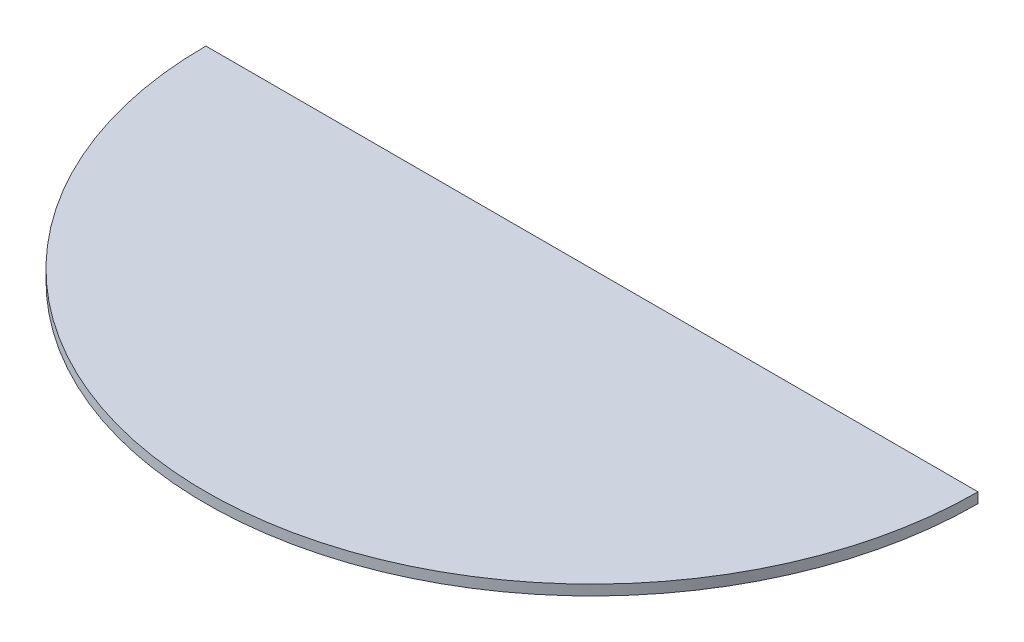
ISO-10303-21;
HEADER;
FILE_DESCRIPTION(('STEP AP214'),'2;1');
FILE_NAME('part.step','',(''),(''),'','','');
FILE_SCHEMA(('AUTOMOTIVE_DESIGN { 1 0 10303 214 1 1 1 1 }'));
ENDSEC;
DATA;
#1=APPLICATION_CONTEXT('core data for automotive mechanical design processes');
#2=APPLICATION_PROTOCOL_DEFINITION('international standard','automotive_design',2000,#1);
#3=PRODUCT_CONTEXT('',#1,'mechanical');
#4=PRODUCT('Part','Part','',(#3));
#5=PRODUCT_RELATED_PRODUCT_CATEGORY('part','',(#4));
#6=PRODUCT_DEFINITION_FORMATION('','',#4);
#7=PRODUCT_DEFINITION_CONTEXT('part definition',#1,'design');
#8=PRODUCT_DEFINITION('design','',#6,#7);
#9=PRODUCT_DEFINITION_SHAPE('','',#8);
#10=(LENGTH_UNIT() NAMED_UNIT(*) SI_UNIT(.MILLI.,.METRE.));
#11=(NAMED_UNIT(*) PLANE_ANGLE_UNIT() SI_UNIT($,.RADIAN.));
#12=(NAMED_UNIT(*) SI_UNIT($,.STERADIAN.) SOLID_ANGLE_UNIT());
#13=UNCERTAINTY_MEASURE_WITH_UNIT(LENGTH_MEASURE(1.E-05),#10,'distance_accuracy_value','');
#14=(GEOMETRIC_REPRESENTATION_CONTEXT(3) GLOBAL_UNCERTAINTY_ASSIGNED_CONTEXT((#13)) GLOBAL_UNIT_ASSIGNED_CONTEXT((#10,
#11,#12)) REPRESENTATION_CONTEXT('',''));
#15=CARTESIAN_POINT('',(0.,0.,0.));
#16=DIRECTION('',(0.,0.,1.));
#17=DIRECTION('',(1.,0.,0.));
#18=AXIS2_PLACEMENT_3D('',#15,#16,#17);
#19=CARTESIAN_POINT('',(0.,1.,0.));
#20=DIRECTION('',(0.,-1.,0.));
#21=DIRECTION('',(0.,0.,-1.));
#22=AXIS2_PLACEMENT_3D('',#19,#20,#21);
#23=CYLINDRICAL_SURFACE('',#22,75.);
#24=CARTESIAN_POINT('',(0.,-1.,0.));
#25=DIRECTION('',(0.,1.,0.));
#26=DIRECTION('',(0.,0.,1.));
#27=AXIS2_PLACEMENT_3D('',#24,#25,#26);
#28=CIRCLE('',#27,75.);
#29=CARTESIAN_POINT('',(-75.,-1.,0.));
#30=VERTEX_POINT('',#29);
#31=CARTESIAN_POINT('',(75.,-1.,0.));
#32=VERTEX_POINT('',#31);
#33=EDGE_CURVE('E72',#30,#32,#28,.T.);
#34=ORIENTED_EDGE('',*,*,#33,.T.);
#35=DIRECTION('',(0.,-1.,0.));
#36=VECTOR('',#35,1.);
#37=CARTESIAN_POINT('',(75.,1.,0.));
#38=LINE('',#37,#36);
#39=CARTESIAN_POINT('',(75.,1.,0.));
#40=VERTEX_POINT('',#39);
#41=EDGE_CURVE('E11',#40,#32,#38,.T.);
#42=ORIENTED_EDGE('',*,*,#41,.F.);
#43=CARTESIAN_POINT('',(0.,1.,0.));
#44=DIRECTION('',(0.,1.,0.));
#45=DIRECTION('',(0.,0.,1.));
#46=AXIS2_PLACEMENT_3D('',#43,#44,#45);
#47=CIRCLE('',#46,75.);
#48=CARTESIAN_POINT('',(-75.,1.,0.));
#49=VERTEX_POINT('',#48);
#50=EDGE_CURVE('E71',#49,#40,#47,.T.);
#51=ORIENTED_EDGE('',*,*,#50,.F.);
#52=DIRECTION('',(0.,-1.,0.));
#53=VECTOR('',#52,1.);
#54=CARTESIAN_POINT('',(-75.,1.,0.));
#55=LINE('',#54,#53);
#56=EDGE_CURVE('E48',#49,#30,#55,.T.);
#57=ORIENTED_EDGE('',*,*,#56,.T.);
#58=EDGE_LOOP('',(#34,#42,#51,#57));
#59=FACE_BOUND('',#58,.T.);
#60=ADVANCED_FACE('F39',(#59),#23,.T.);
#61=CARTESIAN_POINT('',(-75.,1.,0.));
#62=DIRECTION('',(0.,0.,1.));
#63=DIRECTION('',(1.,0.,0.));
#64=AXIS2_PLACEMENT_3D('',#61,#62,#63);
#65=PLANE('',#64);
#66=DIRECTION('',(-1.,0.,0.));
#67=VECTOR('',#66,1.);
#68=CARTESIAN_POINT('',(-75.,-1.,0.));
#69=LINE('',#68,#67);
#70=EDGE_CURVE('E63',#32,#30,#69,.T.);
#71=ORIENTED_EDGE('',*,*,#70,.T.);
#72=ORIENTED_EDGE('',*,*,#56,.F.);
#73=DIRECTION('',(-1.,0.,0.));
#74=VECTOR('',#73,1.);
#75=CARTESIAN_POINT('',(-75.,1.,0.));
#76=LINE('',#75,#74);
#77=EDGE_CURVE('E55',#40,#49,#76,.T.);
#78=ORIENTED_EDGE('',*,*,#77,.F.);
#79=ORIENTED_EDGE('',*,*,#41,.T.);
#80=EDGE_LOOP('',(#71,#72,#78,#79));
#81=FACE_BOUND('',#80,.T.);
#82=ADVANCED_FACE('F66',(#81),#65,.F.);
#83=CARTESIAN_POINT('',(0.,1.,0.));
#84=DIRECTION('',(0.,1.,0.));
#85=DIRECTION('',(0.,0.,1.));
#86=AXIS2_PLACEMENT_3D('',#83,#84,#85);
#87=PLANE('',#86);
#88=ORIENTED_EDGE('',*,*,#50,.T.);
#89=ORIENTED_EDGE('',*,*,#77,.T.);
#90=EDGE_LOOP('',(#88,#89));
#91=FACE_BOUND('',#90,.T.);
#92=ADVANCED_FACE('F83',(#91),#87,.T.);
#93=CARTESIAN_POINT('',(0.,-1.,0.));
#94=DIRECTION('',(0.,1.,0.));
#95=DIRECTION('',(0.,0.,1.));
#96=AXIS2_PLACEMENT_3D('',#93,#94,#95);
#97=PLANE('',#96);
#98=ORIENTED_EDGE('',*,*,#33,.F.);
#99=ORIENTED_EDGE('',*,*,#70,.F.);
#100=EDGE_LOOP('',(#98,#99));
#101=FACE_BOUND('',#100,.T.);
#102=ADVANCED_FACE('F76',(#101),#97,.F.);
#103=CLOSED_SHELL('',(#60,#82,#92,#102));
#104=MANIFOLD_SOLID_BREP('B2',#103);
#105=ADVANCED_BREP_SHAPE_REPRESENTATION('',(#18,#104),#14);
#106=SHAPE_DEFINITION_REPRESENTATION(#9,#105);
ENDSEC;
END-ISO-10303-21;
